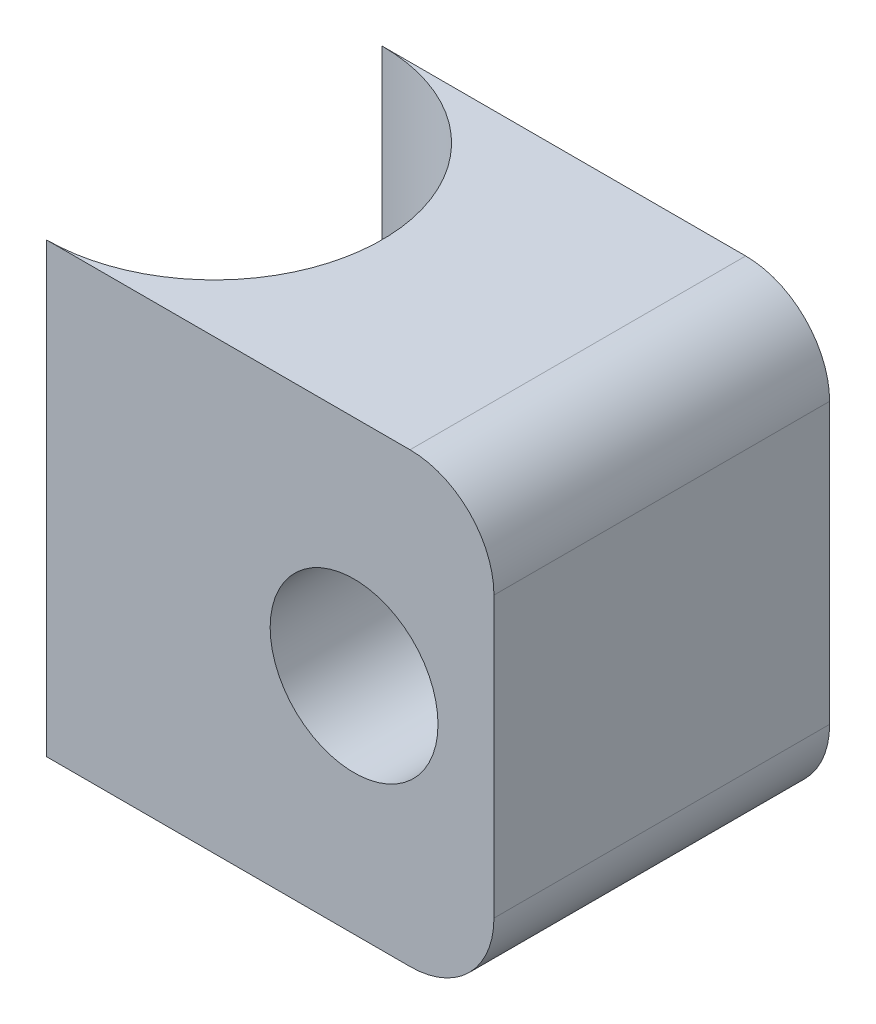
ISO-10303-21;
HEADER;
FILE_DESCRIPTION(('STEP AP214'),'2;1');
FILE_NAME('part.step','',(''),(''),'','','');
FILE_SCHEMA(('AUTOMOTIVE_DESIGN { 1 0 10303 214 1 1 1 1 }'));
ENDSEC;
DATA;
#1=APPLICATION_CONTEXT('core data for automotive mechanical design processes');
#2=APPLICATION_PROTOCOL_DEFINITION('international standard','automotive_design',2000,#1);
#3=PRODUCT_CONTEXT('',#1,'mechanical');
#4=PRODUCT('Part','Part','',(#3));
#5=PRODUCT_RELATED_PRODUCT_CATEGORY('part','',(#4));
#6=PRODUCT_DEFINITION_FORMATION('','',#4);
#7=PRODUCT_DEFINITION_CONTEXT('part definition',#1,'design');
#8=PRODUCT_DEFINITION('design','',#6,#7);
#9=PRODUCT_DEFINITION_SHAPE('','',#8);
#10=(LENGTH_UNIT() NAMED_UNIT(*) SI_UNIT(.MILLI.,.METRE.));
#11=(NAMED_UNIT(*) PLANE_ANGLE_UNIT() SI_UNIT($,.RADIAN.));
#12=(NAMED_UNIT(*) SI_UNIT($,.STERADIAN.) SOLID_ANGLE_UNIT());
#13=UNCERTAINTY_MEASURE_WITH_UNIT(LENGTH_MEASURE(1.E-05),#10,'distance_accuracy_value','');
#14=(GEOMETRIC_REPRESENTATION_CONTEXT(3) GLOBAL_UNCERTAINTY_ASSIGNED_CONTEXT((#13)) GLOBAL_UNIT_ASSIGNED_CONTEXT((#10,
#11,#12)) REPRESENTATION_CONTEXT('',''));
#15=CARTESIAN_POINT('',(0.,0.,0.));
#16=DIRECTION('',(0.,0.,1.));
#17=DIRECTION('',(1.,0.,0.));
#18=AXIS2_PLACEMENT_3D('',#15,#16,#17);
#19=CARTESIAN_POINT('',(5.5,4.,6.));
#20=DIRECTION('',(0.,0.,-1.));
#21=DIRECTION('',(-1.,0.,0.));
#22=AXIS2_PLACEMENT_3D('',#19,#20,#21);
#23=CYLINDRICAL_SURFACE('',#22,1.5);
#24=CARTESIAN_POINT('',(5.5,4.,6.));
#25=DIRECTION('',(0.,0.,-1.));
#26=DIRECTION('',(-1.,0.,0.));
#27=AXIS2_PLACEMENT_3D('',#24,#25,#26);
#28=CIRCLE('',#27,1.5);
#29=CARTESIAN_POINT('',(4.,4.,6.));
#30=VERTEX_POINT('',#29);
#31=EDGE_CURVE('E117',#30,#30,#28,.T.);
#32=ORIENTED_EDGE('',*,*,#31,.F.);
#33=EDGE_LOOP('',(#32));
#34=FACE_BOUND('',#33,.T.);
#35=CARTESIAN_POINT('',(5.5,4.,1.));
#36=DIRECTION('',(0.,0.,-1.));
#37=DIRECTION('',(-1.,0.,0.));
#38=AXIS2_PLACEMENT_3D('',#35,#36,#37);
#39=CIRCLE('',#38,1.5);
#40=CARTESIAN_POINT('',(4.,4.,1.));
#41=VERTEX_POINT('',#40);
#42=EDGE_CURVE('E108',#41,#41,#39,.F.);
#43=ORIENTED_EDGE('',*,*,#42,.F.);
#44=EDGE_LOOP('',(#43));
#45=FACE_BOUND('',#44,.T.);
#46=ADVANCED_FACE('F36',(#34,#45),#23,.F.);
#47=CARTESIAN_POINT('',(0.,0.,6.));
#48=DIRECTION('',(0.,1.,0.));
#49=DIRECTION('',(0.,0.,1.));
#50=AXIS2_PLACEMENT_3D('',#47,#48,#49);
#51=PLANE('',#50);
#52=DIRECTION('',(1.,0.,0.));
#53=VECTOR('',#52,1.);
#54=CARTESIAN_POINT('',(0.,0.,0.));
#55=LINE('',#54,#53);
#56=CARTESIAN_POINT('',(0.,0.,0.));
#57=VERTEX_POINT('',#56);
#58=CARTESIAN_POINT('',(6.5,0.,0.));
#59=VERTEX_POINT('',#58);
#60=EDGE_CURVE('E121',#57,#59,#55,.T.);
#61=ORIENTED_EDGE('',*,*,#60,.T.);
#62=DIRECTION('',(0.,0.,-1.));
#63=VECTOR('',#62,1.);
#64=CARTESIAN_POINT('',(6.5,0.,6.));
#65=LINE('',#64,#63);
#66=CARTESIAN_POINT('',(6.5,0.,6.));
#67=VERTEX_POINT('',#66);
#68=EDGE_CURVE('E11',#59,#67,#65,.F.);
#69=ORIENTED_EDGE('',*,*,#68,.T.);
#70=DIRECTION('',(1.,0.,0.));
#71=VECTOR('',#70,1.);
#72=CARTESIAN_POINT('',(0.,0.,6.));
#73=LINE('',#72,#71);
#74=CARTESIAN_POINT('',(0.,0.,6.));
#75=VERTEX_POINT('',#74);
#76=EDGE_CURVE('E104',#75,#67,#73,.T.);
#77=ORIENTED_EDGE('',*,*,#76,.F.);
#78=CARTESIAN_POINT('',(0.,0.,3.));
#79=DIRECTION('',(0.,-1.,0.));
#80=DIRECTION('',(0.,0.,1.));
#81=AXIS2_PLACEMENT_3D('',#78,#79,#80);
#82=CIRCLE('',#81,3.);
#83=EDGE_CURVE('E91',#57,#75,#82,.T.);
#84=ORIENTED_EDGE('',*,*,#83,.F.);
#85=EDGE_LOOP('',(#61,#69,#77,#84));
#86=FACE_BOUND('',#85,.T.);
#87=ADVANCED_FACE('F110',(#86),#51,.F.);
#88=CARTESIAN_POINT('',(8.,0.,6.));
#89=DIRECTION('',(-1.,0.,0.));
#90=DIRECTION('',(0.,0.,1.));
#91=AXIS2_PLACEMENT_3D('',#88,#89,#90);
#92=PLANE('',#91);
#93=DIRECTION('',(0.,1.,0.));
#94=VECTOR('',#93,1.);
#95=CARTESIAN_POINT('',(8.,0.,0.));
#96=LINE('',#95,#94);
#97=CARTESIAN_POINT('',(8.,1.5,0.));
#98=VERTEX_POINT('',#97);
#99=CARTESIAN_POINT('',(8.,6.5,0.));
#100=VERTEX_POINT('',#99);
#101=EDGE_CURVE('E123',#98,#100,#96,.T.);
#102=ORIENTED_EDGE('',*,*,#101,.T.);
#103=DIRECTION('',(0.,0.,-1.));
#104=VECTOR('',#103,1.);
#105=CARTESIAN_POINT('',(8.,6.5,6.));
#106=LINE('',#105,#104);
#107=CARTESIAN_POINT('',(8.,6.5,6.));
#108=VERTEX_POINT('',#107);
#109=EDGE_CURVE('E57',#100,#108,#106,.F.);
#110=ORIENTED_EDGE('',*,*,#109,.T.);
#111=DIRECTION('',(0.,1.,0.));
#112=VECTOR('',#111,1.);
#113=CARTESIAN_POINT('',(8.,0.,6.));
#114=LINE('',#113,#112);
#115=CARTESIAN_POINT('',(8.,1.5,6.));
#116=VERTEX_POINT('',#115);
#117=EDGE_CURVE('E111',#116,#108,#114,.T.);
#118=ORIENTED_EDGE('',*,*,#117,.F.);
#119=DIRECTION('',(0.,0.,-1.));
#120=VECTOR('',#119,1.);
#121=CARTESIAN_POINT('',(8.,1.5,6.));
#122=LINE('',#121,#120);
#123=EDGE_CURVE('E135',#116,#98,#122,.T.);
#124=ORIENTED_EDGE('',*,*,#123,.T.);
#125=EDGE_LOOP('',(#102,#110,#118,#124));
#126=FACE_BOUND('',#125,.T.);
#127=ADVANCED_FACE('F150',(#126),#92,.F.);
#128=CARTESIAN_POINT('',(8.,8.,6.));
#129=DIRECTION('',(0.,-1.,0.));
#130=DIRECTION('',(1.,0.,0.));
#131=AXIS2_PLACEMENT_3D('',#128,#129,#130);
#132=PLANE('',#131);
#133=DIRECTION('',(-1.,0.,0.));
#134=VECTOR('',#133,1.);
#135=CARTESIAN_POINT('',(8.,8.,6.));
#136=LINE('',#135,#134);
#137=CARTESIAN_POINT('',(6.5,8.,6.));
#138=VERTEX_POINT('',#137);
#139=CARTESIAN_POINT('',(0.,8.,6.));
#140=VERTEX_POINT('',#139);
#141=EDGE_CURVE('E107',#138,#140,#136,.T.);
#142=ORIENTED_EDGE('',*,*,#141,.F.);
#143=DIRECTION('',(0.,0.,-1.));
#144=VECTOR('',#143,1.);
#145=CARTESIAN_POINT('',(6.5,8.,6.));
#146=LINE('',#145,#144);
#147=CARTESIAN_POINT('',(6.5,8.,0.));
#148=VERTEX_POINT('',#147);
#149=EDGE_CURVE('E128',#138,#148,#146,.T.);
#150=ORIENTED_EDGE('',*,*,#149,.T.);
#151=DIRECTION('',(-1.,0.,0.));
#152=VECTOR('',#151,1.);
#153=CARTESIAN_POINT('',(8.,8.,0.));
#154=LINE('',#153,#152);
#155=CARTESIAN_POINT('',(0.,8.,0.));
#156=VERTEX_POINT('',#155);
#157=EDGE_CURVE('E114',#148,#156,#154,.T.);
#158=ORIENTED_EDGE('',*,*,#157,.T.);
#159=CARTESIAN_POINT('',(0.,8.,3.));
#160=DIRECTION('',(0.,-1.,0.));
#161=DIRECTION('',(1.,0.,0.));
#162=AXIS2_PLACEMENT_3D('',#159,#160,#161);
#163=CIRCLE('',#162,3.);
#164=EDGE_CURVE('E100',#156,#140,#163,.T.);
#165=ORIENTED_EDGE('',*,*,#164,.T.);
#166=EDGE_LOOP('',(#142,#150,#158,#165));
#167=FACE_BOUND('',#166,.T.);
#168=ADVANCED_FACE('F144',(#167),#132,.F.);
#169=CARTESIAN_POINT('',(0.,0.,6.));
#170=DIRECTION('',(0.,0.,1.));
#171=DIRECTION('',(1.,0.,0.));
#172=AXIS2_PLACEMENT_3D('',#169,#170,#171);
#173=PLANE('',#172);
#174=ORIENTED_EDGE('',*,*,#31,.T.);
#175=EDGE_LOOP('',(#174));
#176=FACE_BOUND('',#175,.T.);
#177=ORIENTED_EDGE('',*,*,#117,.T.);
#178=CARTESIAN_POINT('',(6.5,6.5,6.));
#179=DIRECTION('',(0.,0.,1.));
#180=DIRECTION('',(1.,0.,0.));
#181=AXIS2_PLACEMENT_3D('',#178,#179,#180);
#182=CIRCLE('',#181,1.5);
#183=EDGE_CURVE('E44',#108,#138,#182,.T.);
#184=ORIENTED_EDGE('',*,*,#183,.T.);
#185=ORIENTED_EDGE('',*,*,#141,.T.);
#186=DIRECTION('',(0.,-1.,0.));
#187=VECTOR('',#186,1.);
#188=CARTESIAN_POINT('',(0.,0.,6.));
#189=LINE('',#188,#187);
#190=EDGE_CURVE('E95',#140,#75,#189,.T.);
#191=ORIENTED_EDGE('',*,*,#190,.T.);
#192=ORIENTED_EDGE('',*,*,#76,.T.);
#193=CARTESIAN_POINT('',(6.5,1.5,6.));
#194=DIRECTION('',(0.,0.,1.));
#195=DIRECTION('',(1.,0.,0.));
#196=AXIS2_PLACEMENT_3D('',#193,#194,#195);
#197=CIRCLE('',#196,1.5);
#198=EDGE_CURVE('E139',#67,#116,#197,.T.);
#199=ORIENTED_EDGE('',*,*,#198,.T.);
#200=EDGE_LOOP('',(#177,#184,#185,#191,#192,#199));
#201=FACE_BOUND('',#200,.T.);
#202=ADVANCED_FACE('F103',(#176,#201),#173,.T.);
#203=CARTESIAN_POINT('',(0.,0.,0.));
#204=DIRECTION('',(0.,0.,1.));
#205=DIRECTION('',(1.,0.,0.));
#206=AXIS2_PLACEMENT_3D('',#203,#204,#205);
#207=PLANE('',#206);
#208=ORIENTED_EDGE('',*,*,#157,.F.);
#209=CARTESIAN_POINT('',(6.5,6.5,0.));
#210=DIRECTION('',(0.,0.,1.));
#211=DIRECTION('',(1.,0.,0.));
#212=AXIS2_PLACEMENT_3D('',#209,#210,#211);
#213=CIRCLE('',#212,1.5);
#214=EDGE_CURVE('E133',#148,#100,#213,.F.);
#215=ORIENTED_EDGE('',*,*,#214,.T.);
#216=ORIENTED_EDGE('',*,*,#101,.F.);
#217=CARTESIAN_POINT('',(6.5,1.5,0.));
#218=DIRECTION('',(0.,0.,1.));
#219=DIRECTION('',(1.,0.,0.));
#220=AXIS2_PLACEMENT_3D('',#217,#218,#219);
#221=CIRCLE('',#220,1.5);
#222=EDGE_CURVE('E131',#98,#59,#221,.F.);
#223=ORIENTED_EDGE('',*,*,#222,.T.);
#224=ORIENTED_EDGE('',*,*,#60,.F.);
#225=DIRECTION('',(0.,-1.,0.));
#226=VECTOR('',#225,1.);
#227=CARTESIAN_POINT('',(0.,0.,0.));
#228=LINE('',#227,#226);
#229=EDGE_CURVE('E98',#156,#57,#228,.T.);
#230=ORIENTED_EDGE('',*,*,#229,.F.);
#231=EDGE_LOOP('',(#208,#215,#216,#223,#224,#230));
#232=FACE_BOUND('',#231,.T.);
#233=ADVANCED_FACE('F149',(#232),#207,.F.);
#234=CARTESIAN_POINT('',(0.,9.,3.));
#235=DIRECTION('',(0.,-1.,0.));
#236=DIRECTION('',(0.,0.,-1.));
#237=AXIS2_PLACEMENT_3D('',#234,#235,#236);
#238=CYLINDRICAL_SURFACE('',#237,3.);
#239=ORIENTED_EDGE('',*,*,#229,.T.);
#240=ORIENTED_EDGE('',*,*,#83,.T.);
#241=ORIENTED_EDGE('',*,*,#190,.F.);
#242=ORIENTED_EDGE('',*,*,#164,.F.);
#243=EDGE_LOOP('',(#239,#240,#241,#242));
#244=FACE_BOUND('',#243,.T.);
#245=ADVANCED_FACE('F93',(#244),#238,.F.);
#246=CARTESIAN_POINT('',(5.5,4.,1.));
#247=DIRECTION('',(0.,0.,-1.));
#248=DIRECTION('',(-1.,0.,0.));
#249=AXIS2_PLACEMENT_3D('',#246,#247,#248);
#250=PLANE('',#249);
#251=ORIENTED_EDGE('',*,*,#42,.T.);
#252=EDGE_LOOP('',(#251));
#253=FACE_BOUND('',#252,.T.);
#254=ADVANCED_FACE('F157',(#253),#250,.F.);
#255=CARTESIAN_POINT('',(6.5,6.5,6.));
#256=DIRECTION('',(0.,0.,-1.));
#257=DIRECTION('',(-1.,0.,0.));
#258=AXIS2_PLACEMENT_3D('',#255,#256,#257);
#259=CYLINDRICAL_SURFACE('',#258,1.5);
#260=ORIENTED_EDGE('',*,*,#183,.F.);
#261=ORIENTED_EDGE('',*,*,#109,.F.);
#262=ORIENTED_EDGE('',*,*,#214,.F.);
#263=ORIENTED_EDGE('',*,*,#149,.F.);
#264=EDGE_LOOP('',(#260,#261,#262,#263));
#265=FACE_BOUND('',#264,.T.);
#266=ADVANCED_FACE('F146',(#265),#259,.T.);
#267=CARTESIAN_POINT('',(6.5,1.5,6.));
#268=DIRECTION('',(0.,0.,-1.));
#269=DIRECTION('',(-1.,0.,0.));
#270=AXIS2_PLACEMENT_3D('',#267,#268,#269);
#271=CYLINDRICAL_SURFACE('',#270,1.5);
#272=ORIENTED_EDGE('',*,*,#198,.F.);
#273=ORIENTED_EDGE('',*,*,#68,.F.);
#274=ORIENTED_EDGE('',*,*,#222,.F.);
#275=ORIENTED_EDGE('',*,*,#123,.F.);
#276=EDGE_LOOP('',(#272,#273,#274,#275));
#277=FACE_BOUND('',#276,.T.);
#278=ADVANCED_FACE('F38',(#277),#271,.T.);
#279=CLOSED_SHELL('',(#46,#87,#127,#168,#202,#233,#245,#254,#266,#278));
#280=MANIFOLD_SOLID_BREP('B2',#279);
#281=ADVANCED_BREP_SHAPE_REPRESENTATION('',(#18,#280),#14);
#282=SHAPE_DEFINITION_REPRESENTATION(#9,#281);
ENDSEC;
END-ISO-10303-21;
